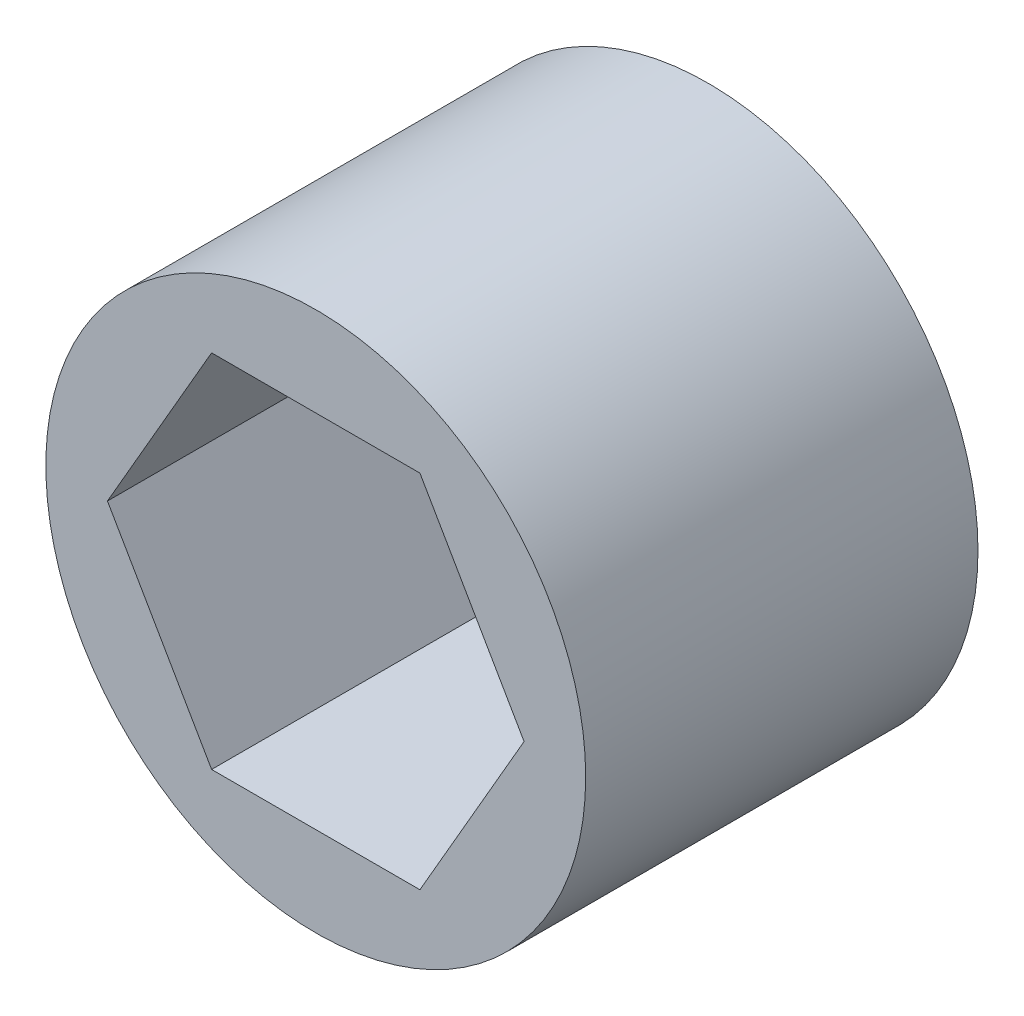
ISO-10303-21;
HEADER;
FILE_DESCRIPTION(('STEP AP214'),'2;1');
FILE_NAME('part.step','',(''),(''),'','','');
FILE_SCHEMA(('AUTOMOTIVE_DESIGN { 1 0 10303 214 1 1 1 1 }'));
ENDSEC;
DATA;
#1=APPLICATION_CONTEXT('core data for automotive mechanical design processes');
#2=APPLICATION_PROTOCOL_DEFINITION('international standard','automotive_design',2000,#1);
#3=PRODUCT_CONTEXT('',#1,'mechanical');
#4=PRODUCT('Part','Part','',(#3));
#5=PRODUCT_RELATED_PRODUCT_CATEGORY('part','',(#4));
#6=PRODUCT_DEFINITION_FORMATION('','',#4);
#7=PRODUCT_DEFINITION_CONTEXT('part definition',#1,'design');
#8=PRODUCT_DEFINITION('design','',#6,#7);
#9=PRODUCT_DEFINITION_SHAPE('','',#8);
#10=(LENGTH_UNIT() NAMED_UNIT(*) SI_UNIT(.MILLI.,.METRE.));
#11=(NAMED_UNIT(*) PLANE_ANGLE_UNIT() SI_UNIT($,.RADIAN.));
#12=(NAMED_UNIT(*) SI_UNIT($,.STERADIAN.) SOLID_ANGLE_UNIT());
#13=UNCERTAINTY_MEASURE_WITH_UNIT(LENGTH_MEASURE(1.E-05),#10,'distance_accuracy_value','');
#14=(GEOMETRIC_REPRESENTATION_CONTEXT(3) GLOBAL_UNCERTAINTY_ASSIGNED_CONTEXT((#13)) GLOBAL_UNIT_ASSIGNED_CONTEXT((#10,
#11,#12)) REPRESENTATION_CONTEXT('',''));
#15=CARTESIAN_POINT('',(0.,0.,0.));
#16=DIRECTION('',(0.,0.,1.));
#17=DIRECTION('',(1.,0.,0.));
#18=AXIS2_PLACEMENT_3D('',#15,#16,#17);
#19=CARTESIAN_POINT('',(0.,0.,5.45));
#20=DIRECTION('',(0.,0.,1.));
#21=DIRECTION('',(1.,0.,0.));
#22=AXIS2_PLACEMENT_3D('',#19,#20,#21);
#23=PLANE('',#22);
#24=CARTESIAN_POINT('',(0.,0.,5.45));
#25=DIRECTION('',(0.,0.,1.));
#26=DIRECTION('',(1.,0.,0.));
#27=AXIS2_PLACEMENT_3D('',#24,#25,#26);
#28=CIRCLE('',#27,7.5);
#29=CARTESIAN_POINT('',(7.5,0.,5.45));
#30=VERTEX_POINT('',#29);
#31=EDGE_CURVE('E11',#30,#30,#28,.T.);
#32=ORIENTED_EDGE('',*,*,#31,.T.);
#33=EDGE_LOOP('',(#32));
#34=FACE_BOUND('',#33,.T.);
#35=DIRECTION('',(-0.5,0.866025403784438,0.));
#36=VECTOR('',#35,1.);
#37=CARTESIAN_POINT('',(5.787936448626,0.,5.45));
#38=LINE('',#37,#36);
#39=CARTESIAN_POINT('',(5.787936448626,0.,5.45));
#40=VERTEX_POINT('',#39);
#41=CARTESIAN_POINT('',(2.893968224313,5.0125,5.45));
#42=VERTEX_POINT('',#41);
#43=EDGE_CURVE('E100',#40,#42,#38,.T.);
#44=ORIENTED_EDGE('',*,*,#43,.F.);
#45=DIRECTION('',(0.5,0.866025403784438,0.));
#46=VECTOR('',#45,1.);
#47=CARTESIAN_POINT('',(2.893968224313,-5.0125,5.45));
#48=LINE('',#47,#46);
#49=CARTESIAN_POINT('',(2.893968224313,-5.0125,5.45));
#50=VERTEX_POINT('',#49);
#51=EDGE_CURVE('E92',#50,#40,#48,.T.);
#52=ORIENTED_EDGE('',*,*,#51,.F.);
#53=DIRECTION('',(1.,0.,0.));
#54=VECTOR('',#53,1.);
#55=CARTESIAN_POINT('',(-2.893968224313,-5.0125,5.45));
#56=LINE('',#55,#54);
#57=CARTESIAN_POINT('',(-2.893968224313,-5.0125,5.45));
#58=VERTEX_POINT('',#57);
#59=EDGE_CURVE('E120',#58,#50,#56,.T.);
#60=ORIENTED_EDGE('',*,*,#59,.F.);
#61=DIRECTION('',(0.5,-0.866025403784439,0.));
#62=VECTOR('',#61,1.);
#63=CARTESIAN_POINT('',(-5.787936448626,0.,5.45));
#64=LINE('',#63,#62);
#65=CARTESIAN_POINT('',(-5.787936448626,0.,5.45));
#66=VERTEX_POINT('',#65);
#67=EDGE_CURVE('E118',#66,#58,#64,.T.);
#68=ORIENTED_EDGE('',*,*,#67,.F.);
#69=DIRECTION('',(-0.5,-0.866025403784438,0.));
#70=VECTOR('',#69,1.);
#71=CARTESIAN_POINT('',(-2.893968224313,5.0125,5.45));
#72=LINE('',#71,#70);
#73=CARTESIAN_POINT('',(-2.893968224313,5.0125,5.45));
#74=VERTEX_POINT('',#73);
#75=EDGE_CURVE('E114',#74,#66,#72,.T.);
#76=ORIENTED_EDGE('',*,*,#75,.F.);
#77=DIRECTION('',(-1.,0.,0.));
#78=VECTOR('',#77,1.);
#79=CARTESIAN_POINT('',(2.893968224313,5.0125,5.45));
#80=LINE('',#79,#78);
#81=EDGE_CURVE('E112',#42,#74,#80,.T.);
#82=ORIENTED_EDGE('',*,*,#81,.F.);
#83=EDGE_LOOP('',(#44,#52,#60,#68,#76,#82));
#84=FACE_BOUND('',#83,.T.);
#85=ADVANCED_FACE('F39',(#34,#84),#23,.T.);
#86=CARTESIAN_POINT('',(0.,0.,-5.45));
#87=DIRECTION('',(0.,0.,1.));
#88=DIRECTION('',(1.,0.,0.));
#89=AXIS2_PLACEMENT_3D('',#86,#87,#88);
#90=PLANE('',#89);
#91=CARTESIAN_POINT('',(0.,0.,-5.45));
#92=DIRECTION('',(0.,0.,1.));
#93=DIRECTION('',(1.,0.,0.));
#94=AXIS2_PLACEMENT_3D('',#91,#92,#93);
#95=CIRCLE('',#94,7.5);
#96=CARTESIAN_POINT('',(7.5,0.,-5.45));
#97=VERTEX_POINT('',#96);
#98=EDGE_CURVE('E43',#97,#97,#95,.T.);
#99=ORIENTED_EDGE('',*,*,#98,.F.);
#100=EDGE_LOOP('',(#99));
#101=FACE_BOUND('',#100,.T.);
#102=DIRECTION('',(0.5,0.866025403784438,0.));
#103=VECTOR('',#102,1.);
#104=CARTESIAN_POINT('',(2.893968224313,-5.0125,-5.45));
#105=LINE('',#104,#103);
#106=CARTESIAN_POINT('',(2.893968224313,-5.0125,-5.45));
#107=VERTEX_POINT('',#106);
#108=CARTESIAN_POINT('',(5.787936448626,0.,-5.45));
#109=VERTEX_POINT('',#108);
#110=EDGE_CURVE('E62',#107,#109,#105,.T.);
#111=ORIENTED_EDGE('',*,*,#110,.T.);
#112=DIRECTION('',(-0.5,0.866025403784438,0.));
#113=VECTOR('',#112,1.);
#114=CARTESIAN_POINT('',(5.787936448626,0.,-5.45));
#115=LINE('',#114,#113);
#116=CARTESIAN_POINT('',(2.893968224313,5.0125,-5.45));
#117=VERTEX_POINT('',#116);
#118=EDGE_CURVE('E107',#109,#117,#115,.T.);
#119=ORIENTED_EDGE('',*,*,#118,.T.);
#120=DIRECTION('',(-1.,0.,0.));
#121=VECTOR('',#120,1.);
#122=CARTESIAN_POINT('',(2.893968224313,5.0125,-5.45));
#123=LINE('',#122,#121);
#124=CARTESIAN_POINT('',(-2.893968224313,5.0125,-5.45));
#125=VERTEX_POINT('',#124);
#126=EDGE_CURVE('E124',#117,#125,#123,.T.);
#127=ORIENTED_EDGE('',*,*,#126,.T.);
#128=DIRECTION('',(-0.5,-0.866025403784438,0.));
#129=VECTOR('',#128,1.);
#130=CARTESIAN_POINT('',(-2.893968224313,5.0125,-5.45));
#131=LINE('',#130,#129);
#132=CARTESIAN_POINT('',(-5.787936448626,0.,-5.45));
#133=VERTEX_POINT('',#132);
#134=EDGE_CURVE('E127',#125,#133,#131,.T.);
#135=ORIENTED_EDGE('',*,*,#134,.T.);
#136=DIRECTION('',(0.5,-0.866025403784439,0.));
#137=VECTOR('',#136,1.);
#138=CARTESIAN_POINT('',(-5.787936448626,0.,-5.45));
#139=LINE('',#138,#137);
#140=CARTESIAN_POINT('',(-2.893968224313,-5.0125,-5.45));
#141=VERTEX_POINT('',#140);
#142=EDGE_CURVE('E130',#133,#141,#139,.T.);
#143=ORIENTED_EDGE('',*,*,#142,.T.);
#144=DIRECTION('',(1.,0.,0.));
#145=VECTOR('',#144,1.);
#146=CARTESIAN_POINT('',(-2.893968224313,-5.0125,-5.45));
#147=LINE('',#146,#145);
#148=EDGE_CURVE('E101',#141,#107,#147,.T.);
#149=ORIENTED_EDGE('',*,*,#148,.T.);
#150=EDGE_LOOP('',(#111,#119,#127,#135,#143,#149));
#151=FACE_BOUND('',#150,.T.);
#152=ADVANCED_FACE('F147',(#101,#151),#90,.F.);
#153=CARTESIAN_POINT('',(0.,0.,5.45));
#154=DIRECTION('',(0.,0.,-1.));
#155=DIRECTION('',(-1.,0.,0.));
#156=AXIS2_PLACEMENT_3D('',#153,#154,#155);
#157=CYLINDRICAL_SURFACE('',#156,7.5);
#158=ORIENTED_EDGE('',*,*,#31,.F.);
#159=EDGE_LOOP('',(#158));
#160=FACE_BOUND('',#159,.T.);
#161=ORIENTED_EDGE('',*,*,#98,.T.);
#162=EDGE_LOOP('',(#161));
#163=FACE_BOUND('',#162,.T.);
#164=ADVANCED_FACE('F41',(#160,#163),#157,.T.);
#165=CARTESIAN_POINT('',(2.893968224313,-5.0125,5.45));
#166=DIRECTION('',(-0.866025403784439,0.5,0.));
#167=DIRECTION('',(-0.5,-0.866025403784439,0.));
#168=AXIS2_PLACEMENT_3D('',#165,#166,#167);
#169=PLANE('',#168);
#170=ORIENTED_EDGE('',*,*,#110,.F.);
#171=DIRECTION('',(0.,0.,-1.));
#172=VECTOR('',#171,1.);
#173=CARTESIAN_POINT('',(2.893968224313,-5.0125,5.45));
#174=LINE('',#173,#172);
#175=EDGE_CURVE('E96',#50,#107,#174,.T.);
#176=ORIENTED_EDGE('',*,*,#175,.F.);
#177=ORIENTED_EDGE('',*,*,#51,.T.);
#178=DIRECTION('',(0.,0.,-1.));
#179=VECTOR('',#178,1.);
#180=CARTESIAN_POINT('',(5.787936448626,0.,5.45));
#181=LINE('',#180,#179);
#182=EDGE_CURVE('E95',#40,#109,#181,.T.);
#183=ORIENTED_EDGE('',*,*,#182,.T.);
#184=EDGE_LOOP('',(#170,#176,#177,#183));
#185=FACE_BOUND('',#184,.T.);
#186=ADVANCED_FACE('F94',(#185),#169,.T.);
#187=CARTESIAN_POINT('',(5.787936448626,0.,5.45));
#188=DIRECTION('',(-0.866025403784438,-0.5,0.));
#189=DIRECTION('',(0.5,-0.866025403784439,0.));
#190=AXIS2_PLACEMENT_3D('',#187,#188,#189);
#191=PLANE('',#190);
#192=ORIENTED_EDGE('',*,*,#118,.F.);
#193=ORIENTED_EDGE('',*,*,#182,.F.);
#194=ORIENTED_EDGE('',*,*,#43,.T.);
#195=DIRECTION('',(0.,0.,-1.));
#196=VECTOR('',#195,1.);
#197=CARTESIAN_POINT('',(2.893968224313,5.0125,5.45));
#198=LINE('',#197,#196);
#199=EDGE_CURVE('E108',#42,#117,#198,.T.);
#200=ORIENTED_EDGE('',*,*,#199,.T.);
#201=EDGE_LOOP('',(#192,#193,#194,#200));
#202=FACE_BOUND('',#201,.T.);
#203=ADVANCED_FACE('F104',(#202),#191,.T.);
#204=CARTESIAN_POINT('',(2.893968224313,5.0125,5.45));
#205=DIRECTION('',(0.,-1.,0.));
#206=DIRECTION('',(1.,0.,0.));
#207=AXIS2_PLACEMENT_3D('',#204,#205,#206);
#208=PLANE('',#207);
#209=ORIENTED_EDGE('',*,*,#126,.F.);
#210=ORIENTED_EDGE('',*,*,#199,.F.);
#211=ORIENTED_EDGE('',*,*,#81,.T.);
#212=DIRECTION('',(0.,0.,-1.));
#213=VECTOR('',#212,1.);
#214=CARTESIAN_POINT('',(-2.893968224313,5.0125,5.45));
#215=LINE('',#214,#213);
#216=EDGE_CURVE('E139',#74,#125,#215,.T.);
#217=ORIENTED_EDGE('',*,*,#216,.T.);
#218=EDGE_LOOP('',(#209,#210,#211,#217));
#219=FACE_BOUND('',#218,.T.);
#220=ADVANCED_FACE('F143',(#219),#208,.T.);
#221=CARTESIAN_POINT('',(-2.893968224313,5.0125,5.45));
#222=DIRECTION('',(0.866025403784439,-0.5,0.));
#223=DIRECTION('',(0.5,0.866025403784439,0.));
#224=AXIS2_PLACEMENT_3D('',#221,#222,#223);
#225=PLANE('',#224);
#226=ORIENTED_EDGE('',*,*,#134,.F.);
#227=ORIENTED_EDGE('',*,*,#216,.F.);
#228=ORIENTED_EDGE('',*,*,#75,.T.);
#229=DIRECTION('',(0.,0.,-1.));
#230=VECTOR('',#229,1.);
#231=CARTESIAN_POINT('',(-5.787936448626,0.,5.45));
#232=LINE('',#231,#230);
#233=EDGE_CURVE('E137',#66,#133,#232,.T.);
#234=ORIENTED_EDGE('',*,*,#233,.T.);
#235=EDGE_LOOP('',(#226,#227,#228,#234));
#236=FACE_BOUND('',#235,.T.);
#237=ADVANCED_FACE('F155',(#236),#225,.T.);
#238=CARTESIAN_POINT('',(-5.787936448626,0.,5.45));
#239=DIRECTION('',(0.866025403784439,0.5,0.));
#240=DIRECTION('',(-0.5,0.866025403784439,0.));
#241=AXIS2_PLACEMENT_3D('',#238,#239,#240);
#242=PLANE('',#241);
#243=ORIENTED_EDGE('',*,*,#142,.F.);
#244=ORIENTED_EDGE('',*,*,#233,.F.);
#245=ORIENTED_EDGE('',*,*,#67,.T.);
#246=DIRECTION('',(0.,0.,-1.));
#247=VECTOR('',#246,1.);
#248=CARTESIAN_POINT('',(-2.893968224313,-5.0125,5.45));
#249=LINE('',#248,#247);
#250=EDGE_CURVE('E54',#58,#141,#249,.T.);
#251=ORIENTED_EDGE('',*,*,#250,.T.);
#252=EDGE_LOOP('',(#243,#244,#245,#251));
#253=FACE_BOUND('',#252,.T.);
#254=ADVANCED_FACE('F153',(#253),#242,.T.);
#255=CARTESIAN_POINT('',(-2.893968224313,-5.0125,5.45));
#256=DIRECTION('',(0.,1.,0.));
#257=DIRECTION('',(-1.,0.,0.));
#258=AXIS2_PLACEMENT_3D('',#255,#256,#257);
#259=PLANE('',#258);
#260=ORIENTED_EDGE('',*,*,#148,.F.);
#261=ORIENTED_EDGE('',*,*,#250,.F.);
#262=ORIENTED_EDGE('',*,*,#59,.T.);
#263=ORIENTED_EDGE('',*,*,#175,.T.);
#264=EDGE_LOOP('',(#260,#261,#262,#263));
#265=FACE_BOUND('',#264,.T.);
#266=ADVANCED_FACE('F149',(#265),#259,.T.);
#267=CLOSED_SHELL('',(#85,#152,#164,#186,#203,#220,#237,#254,#266));
#268=MANIFOLD_SOLID_BREP('B2',#267);
#269=ADVANCED_BREP_SHAPE_REPRESENTATION('',(#18,#268),#14);
#270=SHAPE_DEFINITION_REPRESENTATION(#9,#269);
ENDSEC;
END-ISO-10303-21;
